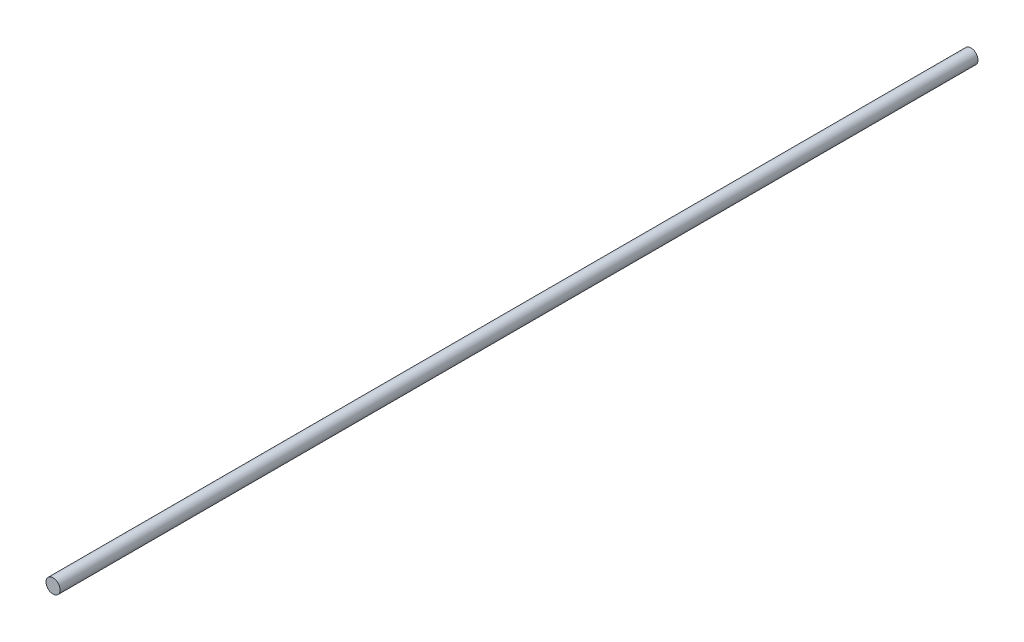
ISO-10303-21;
HEADER;
FILE_DESCRIPTION(('STEP AP214'),'2;1');
FILE_NAME('part.step','',(''),(''),'','','');
FILE_SCHEMA(('AUTOMOTIVE_DESIGN { 1 0 10303 214 1 1 1 1 }'));
ENDSEC;
DATA;
#1=APPLICATION_CONTEXT('core data for automotive mechanical design processes');
#2=APPLICATION_PROTOCOL_DEFINITION('international standard','automotive_design',2000,#1);
#3=PRODUCT_CONTEXT('',#1,'mechanical');
#4=PRODUCT('Part','Part','',(#3));
#5=PRODUCT_RELATED_PRODUCT_CATEGORY('part','',(#4));
#6=PRODUCT_DEFINITION_FORMATION('','',#4);
#7=PRODUCT_DEFINITION_CONTEXT('part definition',#1,'design');
#8=PRODUCT_DEFINITION('design','',#6,#7);
#9=PRODUCT_DEFINITION_SHAPE('','',#8);
#10=(LENGTH_UNIT() NAMED_UNIT(*) SI_UNIT(.MILLI.,.METRE.));
#11=(NAMED_UNIT(*) PLANE_ANGLE_UNIT() SI_UNIT($,.RADIAN.));
#12=(NAMED_UNIT(*) SI_UNIT($,.STERADIAN.) SOLID_ANGLE_UNIT());
#13=UNCERTAINTY_MEASURE_WITH_UNIT(LENGTH_MEASURE(1.E-05),#10,'distance_accuracy_value','');
#14=(GEOMETRIC_REPRESENTATION_CONTEXT(3) GLOBAL_UNCERTAINTY_ASSIGNED_CONTEXT((#13)) GLOBAL_UNIT_ASSIGNED_CONTEXT((#10,
#11,#12)) REPRESENTATION_CONTEXT('',''));
#15=CARTESIAN_POINT('',(0.,0.,0.));
#16=DIRECTION('',(0.,0.,1.));
#17=DIRECTION('',(1.,0.,0.));
#18=AXIS2_PLACEMENT_3D('',#15,#16,#17);
#19=CARTESIAN_POINT('',(0.,0.,520.));
#20=DIRECTION('',(0.,0.,-1.));
#21=DIRECTION('',(-1.,0.,0.));
#22=AXIS2_PLACEMENT_3D('',#19,#20,#21);
#23=CYLINDRICAL_SURFACE('',#22,4.);
#24=CARTESIAN_POINT('',(0.,0.,520.));
#25=DIRECTION('',(0.,0.,1.));
#26=DIRECTION('',(1.,0.,0.));
#27=AXIS2_PLACEMENT_3D('',#24,#25,#26);
#28=CIRCLE('',#27,4.);
#29=CARTESIAN_POINT('',(4.,0.,520.));
#30=VERTEX_POINT('',#29);
#31=EDGE_CURVE('E10',#30,#30,#28,.T.);
#32=ORIENTED_EDGE('',*,*,#31,.F.);
#33=EDGE_LOOP('',(#32));
#34=FACE_BOUND('',#33,.T.);
#35=CARTESIAN_POINT('',(0.,0.,0.));
#36=DIRECTION('',(0.,0.,1.));
#37=DIRECTION('',(1.,0.,0.));
#38=AXIS2_PLACEMENT_3D('',#35,#36,#37);
#39=CIRCLE('',#38,4.);
#40=CARTESIAN_POINT('',(4.,0.,0.));
#41=VERTEX_POINT('',#40);
#42=EDGE_CURVE('E33',#41,#41,#39,.T.);
#43=ORIENTED_EDGE('',*,*,#42,.T.);
#44=EDGE_LOOP('',(#43));
#45=FACE_BOUND('',#44,.T.);
#46=ADVANCED_FACE('F30',(#34,#45),#23,.T.);
#47=CARTESIAN_POINT('',(0.,0.,520.));
#48=DIRECTION('',(0.,0.,1.));
#49=DIRECTION('',(1.,0.,0.));
#50=AXIS2_PLACEMENT_3D('',#47,#48,#49);
#51=PLANE('',#50);
#52=ORIENTED_EDGE('',*,*,#31,.T.);
#53=EDGE_LOOP('',(#52));
#54=FACE_BOUND('',#53,.T.);
#55=ADVANCED_FACE('F45',(#54),#51,.T.);
#56=CARTESIAN_POINT('',(0.,0.,0.));
#57=DIRECTION('',(0.,0.,1.));
#58=DIRECTION('',(1.,0.,0.));
#59=AXIS2_PLACEMENT_3D('',#56,#57,#58);
#60=PLANE('',#59);
#61=ORIENTED_EDGE('',*,*,#42,.F.);
#62=EDGE_LOOP('',(#61));
#63=FACE_BOUND('',#62,.T.);
#64=ADVANCED_FACE('F43',(#63),#60,.F.);
#65=CLOSED_SHELL('',(#46,#55,#64));
#66=MANIFOLD_SOLID_BREP('B2',#65);
#67=ADVANCED_BREP_SHAPE_REPRESENTATION('',(#18,#66),#14);
#68=SHAPE_DEFINITION_REPRESENTATION(#9,#67);
ENDSEC;
END-ISO-10303-21;
